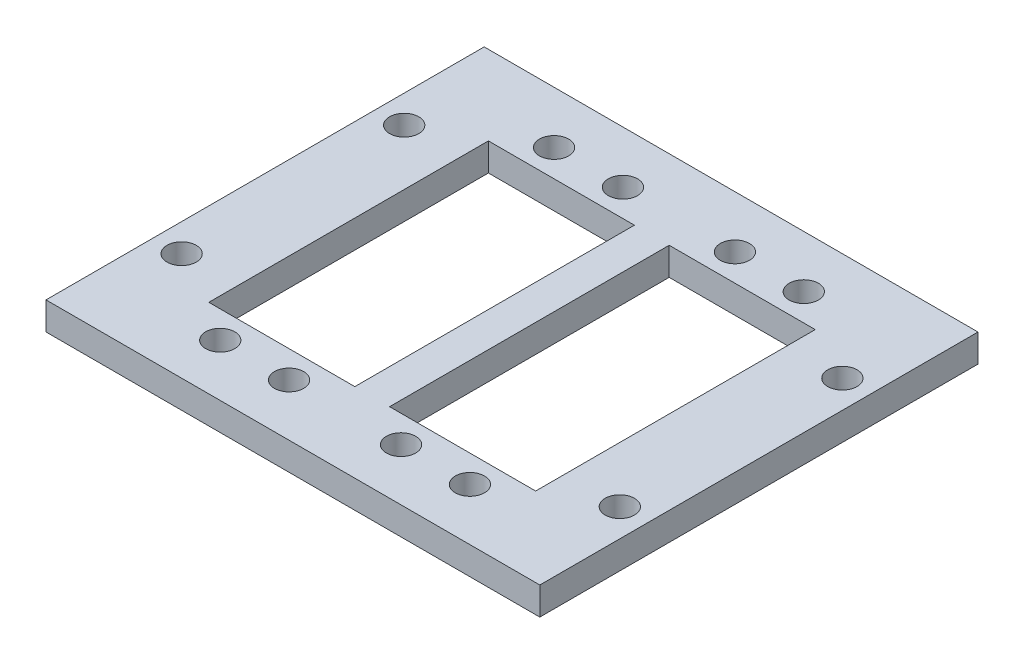
ISO-10303-21;
HEADER;
FILE_DESCRIPTION(('STEP AP214'),'2;1');
FILE_NAME('part.step','',(''),(''),'','','');
FILE_SCHEMA(('AUTOMOTIVE_DESIGN { 1 0 10303 214 1 1 1 1 }'));
ENDSEC;
DATA;
#1=APPLICATION_CONTEXT('core data for automotive mechanical design processes');
#2=APPLICATION_PROTOCOL_DEFINITION('international standard','automotive_design',2000,#1);
#3=PRODUCT_CONTEXT('',#1,'mechanical');
#4=PRODUCT('Part','Part','',(#3));
#5=PRODUCT_RELATED_PRODUCT_CATEGORY('part','',(#4));
#6=PRODUCT_DEFINITION_FORMATION('','',#4);
#7=PRODUCT_DEFINITION_CONTEXT('part definition',#1,'design');
#8=PRODUCT_DEFINITION('design','',#6,#7);
#9=PRODUCT_DEFINITION_SHAPE('','',#8);
#10=(LENGTH_UNIT() NAMED_UNIT(*) SI_UNIT(.MILLI.,.METRE.));
#11=(NAMED_UNIT(*) PLANE_ANGLE_UNIT() SI_UNIT($,.RADIAN.));
#12=(NAMED_UNIT(*) SI_UNIT($,.STERADIAN.) SOLID_ANGLE_UNIT());
#13=UNCERTAINTY_MEASURE_WITH_UNIT(LENGTH_MEASURE(1.E-05),#10,'distance_accuracy_value','');
#14=(GEOMETRIC_REPRESENTATION_CONTEXT(3) GLOBAL_UNCERTAINTY_ASSIGNED_CONTEXT((#13)) GLOBAL_UNIT_ASSIGNED_CONTEXT((#10,
#11,#12)) REPRESENTATION_CONTEXT('',''));
#15=CARTESIAN_POINT('',(0.,0.,0.));
#16=DIRECTION('',(0.,0.,1.));
#17=DIRECTION('',(1.,0.,0.));
#18=AXIS2_PLACEMENT_3D('',#15,#16,#17);
#19=CARTESIAN_POINT('',(0.,4.,-8.96010299831285));
#20=DIRECTION('',(0.,0.,-1.));
#21=DIRECTION('',(-1.,0.,0.));
#22=AXIS2_PLACEMENT_3D('',#19,#20,#21);
#23=PLANE('',#22);
#24=DIRECTION('',(1.,0.,0.));
#25=VECTOR('',#24,1.);
#26=CARTESIAN_POINT('',(0.,0.,-8.96010299831285));
#27=LINE('',#26,#25);
#28=CARTESIAN_POINT('',(-59.5851163441309,0.,-8.96010299831285));
#29=VERTEX_POINT('',#28);
#30=CARTESIAN_POINT('',(-38.5851163441309,0.,-8.96010299831285));
#31=VERTEX_POINT('',#30);
#32=EDGE_CURVE('E250',#29,#31,#27,.T.);
#33=ORIENTED_EDGE('',*,*,#32,.T.);
#34=DIRECTION('',(0.,-1.,0.));
#35=VECTOR('',#34,1.);
#36=CARTESIAN_POINT('',(-38.5851163441309,4.,-8.96010299831285));
#37=LINE('',#36,#35);
#38=CARTESIAN_POINT('',(-38.5851163441309,4.,-8.96010299831285));
#39=VERTEX_POINT('',#38);
#40=EDGE_CURVE('E11',#39,#31,#37,.T.);
#41=ORIENTED_EDGE('',*,*,#40,.F.);
#42=DIRECTION('',(1.,0.,0.));
#43=VECTOR('',#42,1.);
#44=CARTESIAN_POINT('',(0.,4.,-8.96010299831285));
#45=LINE('',#44,#43);
#46=CARTESIAN_POINT('',(-59.5851163441309,4.,-8.96010299831285));
#47=VERTEX_POINT('',#46);
#48=EDGE_CURVE('E150',#47,#39,#45,.T.);
#49=ORIENTED_EDGE('',*,*,#48,.F.);
#50=DIRECTION('',(0.,-1.,0.));
#51=VECTOR('',#50,1.);
#52=CARTESIAN_POINT('',(-59.5851163441309,4.,-8.96010299831285));
#53=LINE('',#52,#51);
#54=EDGE_CURVE('E65',#47,#29,#53,.T.);
#55=ORIENTED_EDGE('',*,*,#54,.T.);
#56=EDGE_LOOP('',(#33,#41,#49,#55));
#57=FACE_BOUND('',#56,.T.);
#58=ADVANCED_FACE('F45',(#57),#23,.F.);
#59=CARTESIAN_POINT('',(-38.5851163441309,4.,0.));
#60=DIRECTION('',(1.,0.,0.));
#61=DIRECTION('',(0.,0.,-1.));
#62=AXIS2_PLACEMENT_3D('',#59,#60,#61);
#63=PLANE('',#62);
#64=DIRECTION('',(0.,0.,1.));
#65=VECTOR('',#64,1.);
#66=CARTESIAN_POINT('',(-38.5851163441309,0.,0.));
#67=LINE('',#66,#65);
#68=CARTESIAN_POINT('',(-38.5851163441309,0.,31.2398970016872));
#69=VERTEX_POINT('',#68);
#70=EDGE_CURVE('E157',#31,#69,#67,.T.);
#71=ORIENTED_EDGE('',*,*,#70,.T.);
#72=DIRECTION('',(0.,-1.,0.));
#73=VECTOR('',#72,1.);
#74=CARTESIAN_POINT('',(-38.5851163441309,4.,31.2398970016872));
#75=LINE('',#74,#73);
#76=CARTESIAN_POINT('',(-38.5851163441309,4.,31.2398970016872));
#77=VERTEX_POINT('',#76);
#78=EDGE_CURVE('E56',#77,#69,#75,.T.);
#79=ORIENTED_EDGE('',*,*,#78,.F.);
#80=DIRECTION('',(0.,0.,1.));
#81=VECTOR('',#80,1.);
#82=CARTESIAN_POINT('',(-38.5851163441309,4.,0.));
#83=LINE('',#82,#81);
#84=EDGE_CURVE('E143',#39,#77,#83,.T.);
#85=ORIENTED_EDGE('',*,*,#84,.F.);
#86=ORIENTED_EDGE('',*,*,#40,.T.);
#87=EDGE_LOOP('',(#71,#79,#85,#86));
#88=FACE_BOUND('',#87,.T.);
#89=ADVANCED_FACE('F156',(#88),#63,.F.);
#90=CARTESIAN_POINT('',(0.,4.,31.2398970016872));
#91=DIRECTION('',(0.,0.,-1.));
#92=DIRECTION('',(-1.,0.,0.));
#93=AXIS2_PLACEMENT_3D('',#90,#91,#92);
#94=PLANE('',#93);
#95=DIRECTION('',(1.,0.,0.));
#96=VECTOR('',#95,1.);
#97=CARTESIAN_POINT('',(0.,0.,31.2398970016872));
#98=LINE('',#97,#96);
#99=CARTESIAN_POINT('',(-59.5851163441309,0.,31.2398970016872));
#100=VERTEX_POINT('',#99);
#101=EDGE_CURVE('E255',#100,#69,#98,.T.);
#102=ORIENTED_EDGE('',*,*,#101,.F.);
#103=DIRECTION('',(0.,-1.,0.));
#104=VECTOR('',#103,1.);
#105=CARTESIAN_POINT('',(-59.5851163441309,4.,31.2398970016872));
#106=LINE('',#105,#104);
#107=CARTESIAN_POINT('',(-59.5851163441309,4.,31.2398970016872));
#108=VERTEX_POINT('',#107);
#109=EDGE_CURVE('E103',#108,#100,#106,.T.);
#110=ORIENTED_EDGE('',*,*,#109,.F.);
#111=DIRECTION('',(1.,0.,0.));
#112=VECTOR('',#111,1.);
#113=CARTESIAN_POINT('',(0.,4.,31.2398970016872));
#114=LINE('',#113,#112);
#115=EDGE_CURVE('E149',#108,#77,#114,.T.);
#116=ORIENTED_EDGE('',*,*,#115,.T.);
#117=ORIENTED_EDGE('',*,*,#78,.T.);
#118=EDGE_LOOP('',(#102,#110,#116,#117));
#119=FACE_BOUND('',#118,.T.);
#120=ADVANCED_FACE('F162',(#119),#94,.T.);
#121=CARTESIAN_POINT('',(-26.5851163441308,4.,0.));
#122=DIRECTION('',(1.,0.,0.));
#123=DIRECTION('',(0.,0.,-1.));
#124=AXIS2_PLACEMENT_3D('',#121,#122,#123);
#125=PLANE('',#124);
#126=DIRECTION('',(0.,0.,1.));
#127=VECTOR('',#126,1.);
#128=CARTESIAN_POINT('',(-26.5851163441308,0.,0.));
#129=LINE('',#128,#127);
#130=CARTESIAN_POINT('',(-26.5851163441308,0.,-20.3601029983129));
#131=VERTEX_POINT('',#130);
#132=CARTESIAN_POINT('',(-26.5851163441308,0.,42.6398970016872));
#133=VERTEX_POINT('',#132);
#134=EDGE_CURVE('E234',#131,#133,#129,.T.);
#135=ORIENTED_EDGE('',*,*,#134,.F.);
#136=DIRECTION('',(0.,-1.,0.));
#137=VECTOR('',#136,1.);
#138=CARTESIAN_POINT('',(-26.5851163441308,4.,-20.3601029983129));
#139=LINE('',#138,#137);
#140=CARTESIAN_POINT('',(-26.5851163441308,4.,-20.3601029983129));
#141=VERTEX_POINT('',#140);
#142=EDGE_CURVE('E313',#141,#131,#139,.T.);
#143=ORIENTED_EDGE('',*,*,#142,.F.);
#144=DIRECTION('',(0.,0.,1.));
#145=VECTOR('',#144,1.);
#146=CARTESIAN_POINT('',(-26.5851163441308,4.,0.));
#147=LINE('',#146,#145);
#148=CARTESIAN_POINT('',(-26.5851163441308,4.,42.6398970016872));
#149=VERTEX_POINT('',#148);
#150=EDGE_CURVE('E618',#141,#149,#147,.T.);
#151=ORIENTED_EDGE('',*,*,#150,.T.);
#152=DIRECTION('',(0.,-1.,0.));
#153=VECTOR('',#152,1.);
#154=CARTESIAN_POINT('',(-26.5851163441308,4.,42.6398970016872));
#155=LINE('',#154,#153);
#156=EDGE_CURVE('E316',#149,#133,#155,.T.);
#157=ORIENTED_EDGE('',*,*,#156,.T.);
#158=EDGE_LOOP('',(#135,#143,#151,#157));
#159=FACE_BOUND('',#158,.T.);
#160=ADVANCED_FACE('F387',(#159),#125,.T.);
#161=CARTESIAN_POINT('',(0.,4.,-20.3601029983129));
#162=DIRECTION('',(0.,0.,-1.));
#163=DIRECTION('',(-1.,0.,0.));
#164=AXIS2_PLACEMENT_3D('',#161,#162,#163);
#165=PLANE('',#164);
#166=DIRECTION('',(1.,0.,0.));
#167=VECTOR('',#166,1.);
#168=CARTESIAN_POINT('',(0.,0.,-20.3601029983129));
#169=LINE('',#168,#167);
#170=CARTESIAN_POINT('',(-97.5851163441309,0.,-20.3601029983129));
#171=VERTEX_POINT('',#170);
#172=EDGE_CURVE('E238',#171,#131,#169,.T.);
#173=ORIENTED_EDGE('',*,*,#172,.F.);
#174=DIRECTION('',(0.,-1.,0.));
#175=VECTOR('',#174,1.);
#176=CARTESIAN_POINT('',(-97.5851163441309,4.,-20.3601029983129));
#177=LINE('',#176,#175);
#178=CARTESIAN_POINT('',(-97.5851163441309,4.,-20.3601029983129));
#179=VERTEX_POINT('',#178);
#180=EDGE_CURVE('E323',#179,#171,#177,.T.);
#181=ORIENTED_EDGE('',*,*,#180,.F.);
#182=DIRECTION('',(1.,0.,0.));
#183=VECTOR('',#182,1.);
#184=CARTESIAN_POINT('',(0.,4.,-20.3601029983129));
#185=LINE('',#184,#183);
#186=EDGE_CURVE('E614',#179,#141,#185,.T.);
#187=ORIENTED_EDGE('',*,*,#186,.T.);
#188=ORIENTED_EDGE('',*,*,#142,.T.);
#189=EDGE_LOOP('',(#173,#181,#187,#188));
#190=FACE_BOUND('',#189,.T.);
#191=ADVANCED_FACE('F383',(#190),#165,.T.);
#192=CARTESIAN_POINT('',(-97.5851163441309,4.,0.));
#193=DIRECTION('',(1.,0.,0.));
#194=DIRECTION('',(0.,0.,-1.));
#195=AXIS2_PLACEMENT_3D('',#192,#193,#194);
#196=PLANE('',#195);
#197=DIRECTION('',(0.,0.,1.));
#198=VECTOR('',#197,1.);
#199=CARTESIAN_POINT('',(-97.5851163441309,0.,0.));
#200=LINE('',#199,#198);
#201=CARTESIAN_POINT('',(-97.5851163441309,0.,42.6398970016872));
#202=VERTEX_POINT('',#201);
#203=EDGE_CURVE('E242',#171,#202,#200,.T.);
#204=ORIENTED_EDGE('',*,*,#203,.T.);
#205=DIRECTION('',(0.,-1.,0.));
#206=VECTOR('',#205,1.);
#207=CARTESIAN_POINT('',(-97.5851163441309,4.,42.6398970016872));
#208=LINE('',#207,#206);
#209=CARTESIAN_POINT('',(-97.5851163441309,4.,42.6398970016872));
#210=VERTEX_POINT('',#209);
#211=EDGE_CURVE('E319',#210,#202,#208,.T.);
#212=ORIENTED_EDGE('',*,*,#211,.F.);
#213=DIRECTION('',(0.,0.,1.));
#214=VECTOR('',#213,1.);
#215=CARTESIAN_POINT('',(-97.5851163441309,4.,0.));
#216=LINE('',#215,#214);
#217=EDGE_CURVE('E608',#179,#210,#216,.T.);
#218=ORIENTED_EDGE('',*,*,#217,.F.);
#219=ORIENTED_EDGE('',*,*,#180,.T.);
#220=EDGE_LOOP('',(#204,#212,#218,#219));
#221=FACE_BOUND('',#220,.T.);
#222=ADVANCED_FACE('F380',(#221),#196,.F.);
#223=CARTESIAN_POINT('',(-85.5767819878561,4.,0.));
#224=DIRECTION('',(1.,0.,0.));
#225=DIRECTION('',(0.,0.,-1.));
#226=AXIS2_PLACEMENT_3D('',#223,#224,#225);
#227=PLANE('',#226);
#228=DIRECTION('',(0.,0.,1.));
#229=VECTOR('',#228,1.);
#230=CARTESIAN_POINT('',(-85.5767819878561,0.,0.));
#231=LINE('',#230,#229);
#232=CARTESIAN_POINT('',(-85.5767819878561,0.,-8.96010299831285));
#233=VERTEX_POINT('',#232);
#234=CARTESIAN_POINT('',(-85.5767819878561,0.,31.2398970016872));
#235=VERTEX_POINT('',#234);
#236=EDGE_CURVE('E219',#233,#235,#231,.T.);
#237=ORIENTED_EDGE('',*,*,#236,.F.);
#238=DIRECTION('',(0.,-1.,0.));
#239=VECTOR('',#238,1.);
#240=CARTESIAN_POINT('',(-85.5767819878561,4.,-8.96010299831285));
#241=LINE('',#240,#239);
#242=CARTESIAN_POINT('',(-85.5767819878561,4.,-8.96010299831285));
#243=VERTEX_POINT('',#242);
#244=EDGE_CURVE('E49',#243,#233,#241,.T.);
#245=ORIENTED_EDGE('',*,*,#244,.F.);
#246=DIRECTION('',(0.,0.,1.));
#247=VECTOR('',#246,1.);
#248=CARTESIAN_POINT('',(-85.5767819878561,4.,0.));
#249=LINE('',#248,#247);
#250=CARTESIAN_POINT('',(-85.5767819878561,4.,31.2398970016872));
#251=VERTEX_POINT('',#250);
#252=EDGE_CURVE('E310',#243,#251,#249,.T.);
#253=ORIENTED_EDGE('',*,*,#252,.T.);
#254=DIRECTION('',(0.,-1.,0.));
#255=VECTOR('',#254,1.);
#256=CARTESIAN_POINT('',(-85.5767819878561,4.,31.2398970016872));
#257=LINE('',#256,#255);
#258=EDGE_CURVE('E218',#251,#235,#257,.T.);
#259=ORIENTED_EDGE('',*,*,#258,.T.);
#260=EDGE_LOOP('',(#237,#245,#253,#259));
#261=FACE_BOUND('',#260,.T.);
#262=ADVANCED_FACE('F47',(#261),#227,.T.);
#263=CARTESIAN_POINT('',(0.,4.,-8.96010299831285));
#264=DIRECTION('',(0.,0.,-1.));
#265=DIRECTION('',(-1.,0.,0.));
#266=AXIS2_PLACEMENT_3D('',#263,#264,#265);
#267=PLANE('',#266);
#268=DIRECTION('',(1.,0.,0.));
#269=VECTOR('',#268,1.);
#270=CARTESIAN_POINT('',(0.,0.,-8.96010299831285));
#271=LINE('',#270,#269);
#272=CARTESIAN_POINT('',(-64.5851163441309,0.,-8.96010299831285));
#273=VERTEX_POINT('',#272);
#274=EDGE_CURVE('E223',#233,#273,#271,.T.);
#275=ORIENTED_EDGE('',*,*,#274,.T.);
#276=DIRECTION('',(0.,-1.,0.));
#277=VECTOR('',#276,1.);
#278=CARTESIAN_POINT('',(-64.5851163441309,4.,-8.96010299831285));
#279=LINE('',#278,#277);
#280=CARTESIAN_POINT('',(-64.5851163441309,4.,-8.96010299831285));
#281=VERTEX_POINT('',#280);
#282=EDGE_CURVE('E332',#281,#273,#279,.T.);
#283=ORIENTED_EDGE('',*,*,#282,.F.);
#284=DIRECTION('',(1.,0.,0.));
#285=VECTOR('',#284,1.);
#286=CARTESIAN_POINT('',(0.,4.,-8.96010299831285));
#287=LINE('',#286,#285);
#288=EDGE_CURVE('E343',#243,#281,#287,.T.);
#289=ORIENTED_EDGE('',*,*,#288,.F.);
#290=ORIENTED_EDGE('',*,*,#244,.T.);
#291=EDGE_LOOP('',(#275,#283,#289,#290));
#292=FACE_BOUND('',#291,.T.);
#293=ADVANCED_FACE('F342',(#292),#267,.F.);
#294=CARTESIAN_POINT('',(-64.5851163441309,4.,0.));
#295=DIRECTION('',(1.,0.,0.));
#296=DIRECTION('',(0.,0.,-1.));
#297=AXIS2_PLACEMENT_3D('',#294,#295,#296);
#298=PLANE('',#297);
#299=DIRECTION('',(0.,0.,1.));
#300=VECTOR('',#299,1.);
#301=CARTESIAN_POINT('',(-64.5851163441309,0.,0.));
#302=LINE('',#301,#300);
#303=CARTESIAN_POINT('',(-64.5851163441309,0.,31.2398970016872));
#304=VERTEX_POINT('',#303);
#305=EDGE_CURVE('E226',#273,#304,#302,.T.);
#306=ORIENTED_EDGE('',*,*,#305,.T.);
#307=DIRECTION('',(0.,-1.,0.));
#308=VECTOR('',#307,1.);
#309=CARTESIAN_POINT('',(-64.5851163441309,4.,31.2398970016872));
#310=LINE('',#309,#308);
#311=CARTESIAN_POINT('',(-64.5851163441309,4.,31.2398970016872));
#312=VERTEX_POINT('',#311);
#313=EDGE_CURVE('E330',#312,#304,#310,.T.);
#314=ORIENTED_EDGE('',*,*,#313,.F.);
#315=DIRECTION('',(0.,0.,1.));
#316=VECTOR('',#315,1.);
#317=CARTESIAN_POINT('',(-64.5851163441309,4.,0.));
#318=LINE('',#317,#316);
#319=EDGE_CURVE('E624',#281,#312,#318,.T.);
#320=ORIENTED_EDGE('',*,*,#319,.F.);
#321=ORIENTED_EDGE('',*,*,#282,.T.);
#322=EDGE_LOOP('',(#306,#314,#320,#321));
#323=FACE_BOUND('',#322,.T.);
#324=ADVANCED_FACE('F355',(#323),#298,.F.);
#325=CARTESIAN_POINT('',(-30.5851163441309,4.,-4.86010299831285));
#326=DIRECTION('',(0.,-1.,0.));
#327=DIRECTION('',(0.,0.,-1.));
#328=AXIS2_PLACEMENT_3D('',#325,#326,#327);
#329=CYLINDRICAL_SURFACE('',#328,2.1);
#330=CARTESIAN_POINT('',(-30.5851163441309,4.,-4.86010299831285));
#331=DIRECTION('',(0.,1.,0.));
#332=DIRECTION('',(0.,0.,1.));
#333=AXIS2_PLACEMENT_3D('',#330,#331,#332);
#334=CIRCLE('',#333,2.1);
#335=CARTESIAN_POINT('',(-30.5851163441309,4.,-2.76010299831285));
#336=VERTEX_POINT('',#335);
#337=EDGE_CURVE('E210',#336,#336,#334,.T.);
#338=ORIENTED_EDGE('',*,*,#337,.T.);
#339=EDGE_LOOP('',(#338));
#340=FACE_BOUND('',#339,.T.);
#341=CARTESIAN_POINT('',(-30.5851163441309,0.,-4.86010299831285));
#342=DIRECTION('',(0.,1.,0.));
#343=DIRECTION('',(0.,0.,1.));
#344=AXIS2_PLACEMENT_3D('',#341,#342,#343);
#345=CIRCLE('',#344,2.1);
#346=CARTESIAN_POINT('',(-30.5851163441309,0.,-2.76010299831285));
#347=VERTEX_POINT('',#346);
#348=EDGE_CURVE('E302',#347,#347,#345,.T.);
#349=ORIENTED_EDGE('',*,*,#348,.F.);
#350=EDGE_LOOP('',(#349));
#351=FACE_BOUND('',#350,.T.);
#352=ADVANCED_FACE('F357',(#340,#351),#329,.F.);
#353=CARTESIAN_POINT('',(-44.1351163441309,4.,-12.8601029983128));
#354=DIRECTION('',(0.,-1.,0.));
#355=DIRECTION('',(0.,0.,-1.));
#356=AXIS2_PLACEMENT_3D('',#353,#354,#355);
#357=CYLINDRICAL_SURFACE('',#356,2.1);
#358=CARTESIAN_POINT('',(-44.1351163441309,4.,-12.8601029983128));
#359=DIRECTION('',(0.,1.,0.));
#360=DIRECTION('',(0.,0.,1.));
#361=AXIS2_PLACEMENT_3D('',#358,#359,#360);
#362=CIRCLE('',#361,2.1);
#363=CARTESIAN_POINT('',(-44.1351163441309,4.,-10.7601029983128));
#364=VERTEX_POINT('',#363);
#365=EDGE_CURVE('E206',#364,#364,#362,.T.);
#366=ORIENTED_EDGE('',*,*,#365,.T.);
#367=EDGE_LOOP('',(#366));
#368=FACE_BOUND('',#367,.T.);
#369=CARTESIAN_POINT('',(-44.1351163441309,0.,-12.8601029983128));
#370=DIRECTION('',(0.,1.,0.));
#371=DIRECTION('',(0.,0.,1.));
#372=AXIS2_PLACEMENT_3D('',#369,#370,#371);
#373=CIRCLE('',#372,2.1);
#374=CARTESIAN_POINT('',(-44.1351163441309,0.,-10.7601029983128));
#375=VERTEX_POINT('',#374);
#376=EDGE_CURVE('E298',#375,#375,#373,.T.);
#377=ORIENTED_EDGE('',*,*,#376,.F.);
#378=EDGE_LOOP('',(#377));
#379=FACE_BOUND('',#378,.T.);
#380=ADVANCED_FACE('F363',(#368,#379),#357,.F.);
#381=CARTESIAN_POINT('',(-54.0351163441309,4.,-12.8601029983129));
#382=DIRECTION('',(0.,-1.,0.));
#383=DIRECTION('',(0.,0.,-1.));
#384=AXIS2_PLACEMENT_3D('',#381,#382,#383);
#385=CYLINDRICAL_SURFACE('',#384,2.1);
#386=CARTESIAN_POINT('',(-54.0351163441309,4.,-12.8601029983129));
#387=DIRECTION('',(0.,1.,0.));
#388=DIRECTION('',(0.,0.,1.));
#389=AXIS2_PLACEMENT_3D('',#386,#387,#388);
#390=CIRCLE('',#389,2.1);
#391=CARTESIAN_POINT('',(-54.0351163441309,4.,-10.7601029983129));
#392=VERTEX_POINT('',#391);
#393=EDGE_CURVE('E202',#392,#392,#390,.T.);
#394=ORIENTED_EDGE('',*,*,#393,.T.);
#395=EDGE_LOOP('',(#394));
#396=FACE_BOUND('',#395,.T.);
#397=CARTESIAN_POINT('',(-54.0351163441309,0.,-12.8601029983129));
#398=DIRECTION('',(0.,1.,0.));
#399=DIRECTION('',(0.,0.,1.));
#400=AXIS2_PLACEMENT_3D('',#397,#398,#399);
#401=CIRCLE('',#400,2.1);
#402=CARTESIAN_POINT('',(-54.0351163441309,0.,-10.7601029983129));
#403=VERTEX_POINT('',#402);
#404=EDGE_CURVE('E294',#403,#403,#401,.T.);
#405=ORIENTED_EDGE('',*,*,#404,.F.);
#406=EDGE_LOOP('',(#405));
#407=FACE_BOUND('',#406,.T.);
#408=ADVANCED_FACE('F408',(#396,#407),#385,.F.);
#409=CARTESIAN_POINT('',(-70.1351163441309,4.,-12.8601029983129));
#410=DIRECTION('',(0.,-1.,0.));
#411=DIRECTION('',(0.,0.,-1.));
#412=AXIS2_PLACEMENT_3D('',#409,#410,#411);
#413=CYLINDRICAL_SURFACE('',#412,2.09999999999999);
#414=CARTESIAN_POINT('',(-70.1351163441309,4.,-12.8601029983129));
#415=DIRECTION('',(0.,1.,0.));
#416=DIRECTION('',(0.,0.,1.));
#417=AXIS2_PLACEMENT_3D('',#414,#415,#416);
#418=CIRCLE('',#417,2.09999999999999);
#419=CARTESIAN_POINT('',(-70.1351163441309,4.,-10.7601029983129));
#420=VERTEX_POINT('',#419);
#421=EDGE_CURVE('E198',#420,#420,#418,.T.);
#422=ORIENTED_EDGE('',*,*,#421,.T.);
#423=EDGE_LOOP('',(#422));
#424=FACE_BOUND('',#423,.T.);
#425=CARTESIAN_POINT('',(-70.1351163441309,0.,-12.8601029983129));
#426=DIRECTION('',(0.,1.,0.));
#427=DIRECTION('',(0.,0.,1.));
#428=AXIS2_PLACEMENT_3D('',#425,#426,#427);
#429=CIRCLE('',#428,2.09999999999999);
#430=CARTESIAN_POINT('',(-70.1351163441309,0.,-10.7601029983129));
#431=VERTEX_POINT('',#430);
#432=EDGE_CURVE('E290',#431,#431,#429,.T.);
#433=ORIENTED_EDGE('',*,*,#432,.F.);
#434=EDGE_LOOP('',(#433));
#435=FACE_BOUND('',#434,.T.);
#436=ADVANCED_FACE('F412',(#424,#435),#413,.F.);
#437=CARTESIAN_POINT('',(-80.0351163441309,4.,-12.8601029983129));
#438=DIRECTION('',(0.,-1.,0.));
#439=DIRECTION('',(0.,0.,-1.));
#440=AXIS2_PLACEMENT_3D('',#437,#438,#439);
#441=CYLINDRICAL_SURFACE('',#440,2.09999999999999);
#442=CARTESIAN_POINT('',(-80.0351163441309,4.,-12.8601029983129));
#443=DIRECTION('',(0.,1.,0.));
#444=DIRECTION('',(0.,0.,1.));
#445=AXIS2_PLACEMENT_3D('',#442,#443,#444);
#446=CIRCLE('',#445,2.09999999999999);
#447=CARTESIAN_POINT('',(-80.0351163441309,4.,-10.7601029983129));
#448=VERTEX_POINT('',#447);
#449=EDGE_CURVE('E194',#448,#448,#446,.T.);
#450=ORIENTED_EDGE('',*,*,#449,.T.);
#451=EDGE_LOOP('',(#450));
#452=FACE_BOUND('',#451,.T.);
#453=CARTESIAN_POINT('',(-80.0351163441309,0.,-12.8601029983129));
#454=DIRECTION('',(0.,1.,0.));
#455=DIRECTION('',(0.,0.,1.));
#456=AXIS2_PLACEMENT_3D('',#453,#454,#455);
#457=CIRCLE('',#456,2.09999999999999);
#458=CARTESIAN_POINT('',(-80.0351163441309,0.,-10.7601029983129));
#459=VERTEX_POINT('',#458);
#460=EDGE_CURVE('E286',#459,#459,#457,.T.);
#461=ORIENTED_EDGE('',*,*,#460,.F.);
#462=EDGE_LOOP('',(#461));
#463=FACE_BOUND('',#462,.T.);
#464=ADVANCED_FACE('F416',(#452,#463),#441,.F.);
#465=CARTESIAN_POINT('',(-93.5851163441309,4.,27.1398970016872));
#466=DIRECTION('',(0.,-1.,0.));
#467=DIRECTION('',(0.,0.,-1.));
#468=AXIS2_PLACEMENT_3D('',#465,#466,#467);
#469=CYLINDRICAL_SURFACE('',#468,2.10000000000002);
#470=CARTESIAN_POINT('',(-93.5851163441309,4.,27.1398970016872));
#471=DIRECTION('',(0.,1.,0.));
#472=DIRECTION('',(0.,0.,1.));
#473=AXIS2_PLACEMENT_3D('',#470,#471,#472);
#474=CIRCLE('',#473,2.10000000000002);
#475=CARTESIAN_POINT('',(-93.5851163441309,4.,29.2398970016872));
#476=VERTEX_POINT('',#475);
#477=EDGE_CURVE('E190',#476,#476,#474,.F.);
#478=ORIENTED_EDGE('',*,*,#477,.F.);
#479=EDGE_LOOP('',(#478));
#480=FACE_BOUND('',#479,.T.);
#481=CARTESIAN_POINT('',(-93.5851163441309,0.,27.1398970016872));
#482=DIRECTION('',(0.,1.,0.));
#483=DIRECTION('',(0.,0.,1.));
#484=AXIS2_PLACEMENT_3D('',#481,#482,#483);
#485=CIRCLE('',#484,2.10000000000002);
#486=CARTESIAN_POINT('',(-93.5851163441309,0.,29.2398970016872));
#487=VERTEX_POINT('',#486);
#488=EDGE_CURVE('E282',#487,#487,#485,.F.);
#489=ORIENTED_EDGE('',*,*,#488,.T.);
#490=EDGE_LOOP('',(#489));
#491=FACE_BOUND('',#490,.T.);
#492=ADVANCED_FACE('F420',(#480,#491),#469,.F.);
#493=CARTESIAN_POINT('',(-80.0351163441309,4.,35.1398970016872));
#494=DIRECTION('',(0.,-1.,0.));
#495=DIRECTION('',(0.,0.,-1.));
#496=AXIS2_PLACEMENT_3D('',#493,#494,#495);
#497=CYLINDRICAL_SURFACE('',#496,2.09999999999999);
#498=CARTESIAN_POINT('',(-80.0351163441309,4.,35.1398970016872));
#499=DIRECTION('',(0.,1.,0.));
#500=DIRECTION('',(0.,0.,1.));
#501=AXIS2_PLACEMENT_3D('',#498,#499,#500);
#502=CIRCLE('',#501,2.09999999999999);
#503=CARTESIAN_POINT('',(-80.0351163441309,4.,37.2398970016872));
#504=VERTEX_POINT('',#503);
#505=EDGE_CURVE('E186',#504,#504,#502,.F.);
#506=ORIENTED_EDGE('',*,*,#505,.F.);
#507=EDGE_LOOP('',(#506));
#508=FACE_BOUND('',#507,.T.);
#509=CARTESIAN_POINT('',(-80.0351163441309,0.,35.1398970016872));
#510=DIRECTION('',(0.,1.,0.));
#511=DIRECTION('',(0.,0.,1.));
#512=AXIS2_PLACEMENT_3D('',#509,#510,#511);
#513=CIRCLE('',#512,2.09999999999999);
#514=CARTESIAN_POINT('',(-80.0351163441309,0.,37.2398970016872));
#515=VERTEX_POINT('',#514);
#516=EDGE_CURVE('E278',#515,#515,#513,.F.);
#517=ORIENTED_EDGE('',*,*,#516,.T.);
#518=EDGE_LOOP('',(#517));
#519=FACE_BOUND('',#518,.T.);
#520=ADVANCED_FACE('F424',(#508,#519),#497,.F.);
#521=CARTESIAN_POINT('',(-44.1351163441309,4.,35.1398970016872));
#522=DIRECTION('',(0.,-1.,0.));
#523=DIRECTION('',(0.,0.,-1.));
#524=AXIS2_PLACEMENT_3D('',#521,#522,#523);
#525=CYLINDRICAL_SURFACE('',#524,2.1);
#526=CARTESIAN_POINT('',(-44.1351163441309,4.,35.1398970016872));
#527=DIRECTION('',(0.,1.,0.));
#528=DIRECTION('',(0.,0.,1.));
#529=AXIS2_PLACEMENT_3D('',#526,#527,#528);
#530=CIRCLE('',#529,2.1);
#531=CARTESIAN_POINT('',(-44.1351163441309,4.,37.2398970016872));
#532=VERTEX_POINT('',#531);
#533=EDGE_CURVE('E182',#532,#532,#530,.F.);
#534=ORIENTED_EDGE('',*,*,#533,.F.);
#535=EDGE_LOOP('',(#534));
#536=FACE_BOUND('',#535,.T.);
#537=CARTESIAN_POINT('',(-44.1351163441309,0.,35.1398970016872));
#538=DIRECTION('',(0.,1.,0.));
#539=DIRECTION('',(0.,0.,1.));
#540=AXIS2_PLACEMENT_3D('',#537,#538,#539);
#541=CIRCLE('',#540,2.1);
#542=CARTESIAN_POINT('',(-44.1351163441309,0.,37.2398970016872));
#543=VERTEX_POINT('',#542);
#544=EDGE_CURVE('E274',#543,#543,#541,.F.);
#545=ORIENTED_EDGE('',*,*,#544,.T.);
#546=EDGE_LOOP('',(#545));
#547=FACE_BOUND('',#546,.T.);
#548=ADVANCED_FACE('F428',(#536,#547),#525,.F.);
#549=CARTESIAN_POINT('',(-30.5851163441309,4.,27.1398970016872));
#550=DIRECTION('',(0.,-1.,0.));
#551=DIRECTION('',(0.,0.,-1.));
#552=AXIS2_PLACEMENT_3D('',#549,#550,#551);
#553=CYLINDRICAL_SURFACE('',#552,2.1);
#554=CARTESIAN_POINT('',(-30.5851163441309,4.,27.1398970016872));
#555=DIRECTION('',(0.,1.,0.));
#556=DIRECTION('',(0.,0.,1.));
#557=AXIS2_PLACEMENT_3D('',#554,#555,#556);
#558=CIRCLE('',#557,2.1);
#559=CARTESIAN_POINT('',(-30.5851163441309,4.,29.2398970016872));
#560=VERTEX_POINT('',#559);
#561=EDGE_CURVE('E178',#560,#560,#558,.F.);
#562=ORIENTED_EDGE('',*,*,#561,.F.);
#563=EDGE_LOOP('',(#562));
#564=FACE_BOUND('',#563,.T.);
#565=CARTESIAN_POINT('',(-30.5851163441309,0.,27.1398970016872));
#566=DIRECTION('',(0.,1.,0.));
#567=DIRECTION('',(0.,0.,1.));
#568=AXIS2_PLACEMENT_3D('',#565,#566,#567);
#569=CIRCLE('',#568,2.1);
#570=CARTESIAN_POINT('',(-30.5851163441309,0.,29.2398970016872));
#571=VERTEX_POINT('',#570);
#572=EDGE_CURVE('E270',#571,#571,#569,.F.);
#573=ORIENTED_EDGE('',*,*,#572,.T.);
#574=EDGE_LOOP('',(#573));
#575=FACE_BOUND('',#574,.T.);
#576=ADVANCED_FACE('F432',(#564,#575),#553,.F.);
#577=CARTESIAN_POINT('',(-54.0351163441309,4.,35.1398970016872));
#578=DIRECTION('',(0.,-1.,0.));
#579=DIRECTION('',(0.,0.,-1.));
#580=AXIS2_PLACEMENT_3D('',#577,#578,#579);
#581=CYLINDRICAL_SURFACE('',#580,2.1);
#582=CARTESIAN_POINT('',(-54.0351163441309,4.,35.1398970016872));
#583=DIRECTION('',(0.,1.,0.));
#584=DIRECTION('',(0.,0.,1.));
#585=AXIS2_PLACEMENT_3D('',#582,#583,#584);
#586=CIRCLE('',#585,2.1);
#587=CARTESIAN_POINT('',(-54.0351163441309,4.,37.2398970016872));
#588=VERTEX_POINT('',#587);
#589=EDGE_CURVE('E174',#588,#588,#586,.F.);
#590=ORIENTED_EDGE('',*,*,#589,.F.);
#591=EDGE_LOOP('',(#590));
#592=FACE_BOUND('',#591,.T.);
#593=CARTESIAN_POINT('',(-54.0351163441309,0.,35.1398970016872));
#594=DIRECTION('',(0.,1.,0.));
#595=DIRECTION('',(0.,0.,1.));
#596=AXIS2_PLACEMENT_3D('',#593,#594,#595);
#597=CIRCLE('',#596,2.1);
#598=CARTESIAN_POINT('',(-54.0351163441309,0.,37.2398970016872));
#599=VERTEX_POINT('',#598);
#600=EDGE_CURVE('E266',#599,#599,#597,.F.);
#601=ORIENTED_EDGE('',*,*,#600,.T.);
#602=EDGE_LOOP('',(#601));
#603=FACE_BOUND('',#602,.T.);
#604=ADVANCED_FACE('F436',(#592,#603),#581,.F.);
#605=CARTESIAN_POINT('',(-70.1351163441309,4.,35.1398970016872));
#606=DIRECTION('',(0.,-1.,0.));
#607=DIRECTION('',(0.,0.,-1.));
#608=AXIS2_PLACEMENT_3D('',#605,#606,#607);
#609=CYLINDRICAL_SURFACE('',#608,2.09999999999999);
#610=CARTESIAN_POINT('',(-70.1351163441309,4.,35.1398970016872));
#611=DIRECTION('',(0.,1.,0.));
#612=DIRECTION('',(0.,0.,1.));
#613=AXIS2_PLACEMENT_3D('',#610,#611,#612);
#614=CIRCLE('',#613,2.09999999999999);
#615=CARTESIAN_POINT('',(-70.1351163441309,4.,37.2398970016872));
#616=VERTEX_POINT('',#615);
#617=EDGE_CURVE('E167',#616,#616,#614,.F.);
#618=ORIENTED_EDGE('',*,*,#617,.F.);
#619=EDGE_LOOP('',(#618));
#620=FACE_BOUND('',#619,.T.);
#621=CARTESIAN_POINT('',(-70.1351163441309,0.,35.1398970016872));
#622=DIRECTION('',(0.,1.,0.));
#623=DIRECTION('',(0.,0.,1.));
#624=AXIS2_PLACEMENT_3D('',#621,#622,#623);
#625=CIRCLE('',#624,2.09999999999999);
#626=CARTESIAN_POINT('',(-70.1351163441309,0.,37.2398970016872));
#627=VERTEX_POINT('',#626);
#628=EDGE_CURVE('E262',#627,#627,#625,.F.);
#629=ORIENTED_EDGE('',*,*,#628,.T.);
#630=EDGE_LOOP('',(#629));
#631=FACE_BOUND('',#630,.T.);
#632=ADVANCED_FACE('F440',(#620,#631),#609,.F.);
#633=CARTESIAN_POINT('',(-59.5851163441309,4.,0.));
#634=DIRECTION('',(1.,0.,0.));
#635=DIRECTION('',(0.,0.,-1.));
#636=AXIS2_PLACEMENT_3D('',#633,#634,#635);
#637=PLANE('',#636);
#638=DIRECTION('',(0.,0.,1.));
#639=VECTOR('',#638,1.);
#640=CARTESIAN_POINT('',(-59.5851163441309,0.,0.));
#641=LINE('',#640,#639);
#642=EDGE_CURVE('E258',#29,#100,#641,.T.);
#643=ORIENTED_EDGE('',*,*,#642,.F.);
#644=ORIENTED_EDGE('',*,*,#54,.F.);
#645=DIRECTION('',(0.,0.,1.));
#646=VECTOR('',#645,1.);
#647=CARTESIAN_POINT('',(-59.5851163441309,4.,0.));
#648=LINE('',#647,#646);
#649=EDGE_CURVE('E164',#47,#108,#648,.T.);
#650=ORIENTED_EDGE('',*,*,#649,.T.);
#651=ORIENTED_EDGE('',*,*,#109,.T.);
#652=EDGE_LOOP('',(#643,#644,#650,#651));
#653=FACE_BOUND('',#652,.T.);
#654=ADVANCED_FACE('F378',(#653),#637,.T.);
#655=CARTESIAN_POINT('',(0.,4.,42.6398970016872));
#656=DIRECTION('',(0.,0.,-1.));
#657=DIRECTION('',(-1.,0.,0.));
#658=AXIS2_PLACEMENT_3D('',#655,#656,#657);
#659=PLANE('',#658);
#660=DIRECTION('',(1.,0.,0.));
#661=VECTOR('',#660,1.);
#662=CARTESIAN_POINT('',(0.,0.,42.6398970016872));
#663=LINE('',#662,#661);
#664=EDGE_CURVE('E246',#202,#133,#663,.T.);
#665=ORIENTED_EDGE('',*,*,#664,.T.);
#666=ORIENTED_EDGE('',*,*,#156,.F.);
#667=DIRECTION('',(1.,0.,0.));
#668=VECTOR('',#667,1.);
#669=CARTESIAN_POINT('',(0.,4.,42.6398970016872));
#670=LINE('',#669,#668);
#671=EDGE_CURVE('E606',#210,#149,#670,.T.);
#672=ORIENTED_EDGE('',*,*,#671,.F.);
#673=ORIENTED_EDGE('',*,*,#211,.T.);
#674=EDGE_LOOP('',(#665,#666,#672,#673));
#675=FACE_BOUND('',#674,.T.);
#676=ADVANCED_FACE('F375',(#675),#659,.F.);
#677=CARTESIAN_POINT('',(0.,4.,31.2398970016872));
#678=DIRECTION('',(0.,0.,-1.));
#679=DIRECTION('',(-1.,0.,0.));
#680=AXIS2_PLACEMENT_3D('',#677,#678,#679);
#681=PLANE('',#680);
#682=DIRECTION('',(1.,0.,0.));
#683=VECTOR('',#682,1.);
#684=CARTESIAN_POINT('',(0.,0.,31.2398970016872));
#685=LINE('',#684,#683);
#686=EDGE_CURVE('E230',#235,#304,#685,.T.);
#687=ORIENTED_EDGE('',*,*,#686,.F.);
#688=ORIENTED_EDGE('',*,*,#258,.F.);
#689=DIRECTION('',(1.,0.,0.));
#690=VECTOR('',#689,1.);
#691=CARTESIAN_POINT('',(0.,4.,31.2398970016872));
#692=LINE('',#691,#690);
#693=EDGE_CURVE('E353',#251,#312,#692,.T.);
#694=ORIENTED_EDGE('',*,*,#693,.T.);
#695=ORIENTED_EDGE('',*,*,#313,.T.);
#696=EDGE_LOOP('',(#687,#688,#694,#695));
#697=FACE_BOUND('',#696,.T.);
#698=ADVANCED_FACE('F352',(#697),#681,.T.);
#699=CARTESIAN_POINT('',(-93.5851163441309,4.,-4.86010299831286));
#700=DIRECTION('',(0.,-1.,0.));
#701=DIRECTION('',(0.,0.,-1.));
#702=AXIS2_PLACEMENT_3D('',#699,#700,#701);
#703=CYLINDRICAL_SURFACE('',#702,2.10000000000002);
#704=CARTESIAN_POINT('',(-93.5851163441309,4.,-4.86010299831286));
#705=DIRECTION('',(0.,1.,0.));
#706=DIRECTION('',(0.,0.,1.));
#707=AXIS2_PLACEMENT_3D('',#704,#705,#706);
#708=CIRCLE('',#707,2.10000000000002);
#709=CARTESIAN_POINT('',(-93.5851163441309,4.,-2.76010299831284));
#710=VERTEX_POINT('',#709);
#711=EDGE_CURVE('E214',#710,#710,#708,.T.);
#712=ORIENTED_EDGE('',*,*,#711,.T.);
#713=EDGE_LOOP('',(#712));
#714=FACE_BOUND('',#713,.T.);
#715=CARTESIAN_POINT('',(-93.5851163441309,0.,-4.86010299831286));
#716=DIRECTION('',(0.,1.,0.));
#717=DIRECTION('',(0.,0.,1.));
#718=AXIS2_PLACEMENT_3D('',#715,#716,#717);
#719=CIRCLE('',#718,2.10000000000002);
#720=CARTESIAN_POINT('',(-93.5851163441309,0.,-2.76010299831284));
#721=VERTEX_POINT('',#720);
#722=EDGE_CURVE('E306',#721,#721,#719,.T.);
#723=ORIENTED_EDGE('',*,*,#722,.F.);
#724=EDGE_LOOP('',(#723));
#725=FACE_BOUND('',#724,.T.);
#726=ADVANCED_FACE('F392',(#714,#725),#703,.F.);
#727=CARTESIAN_POINT('',(0.,4.,0.));
#728=DIRECTION('',(0.,1.,0.));
#729=DIRECTION('',(0.,0.,1.));
#730=AXIS2_PLACEMENT_3D('',#727,#728,#729);
#731=PLANE('',#730);
#732=ORIENTED_EDGE('',*,*,#252,.F.);
#733=ORIENTED_EDGE('',*,*,#288,.T.);
#734=ORIENTED_EDGE('',*,*,#319,.T.);
#735=ORIENTED_EDGE('',*,*,#693,.F.);
#736=EDGE_LOOP('',(#732,#733,#734,#735));
#737=FACE_BOUND('',#736,.T.);
#738=ORIENTED_EDGE('',*,*,#150,.F.);
#739=ORIENTED_EDGE('',*,*,#186,.F.);
#740=ORIENTED_EDGE('',*,*,#217,.T.);
#741=ORIENTED_EDGE('',*,*,#671,.T.);
#742=EDGE_LOOP('',(#738,#739,#740,#741));
#743=FACE_BOUND('',#742,.T.);
#744=ORIENTED_EDGE('',*,*,#48,.T.);
#745=ORIENTED_EDGE('',*,*,#84,.T.);
#746=ORIENTED_EDGE('',*,*,#115,.F.);
#747=ORIENTED_EDGE('',*,*,#649,.F.);
#748=EDGE_LOOP('',(#744,#745,#746,#747));
#749=FACE_BOUND('',#748,.T.);
#750=ORIENTED_EDGE('',*,*,#617,.T.);
#751=EDGE_LOOP('',(#750));
#752=FACE_BOUND('',#751,.T.);
#753=ORIENTED_EDGE('',*,*,#589,.T.);
#754=EDGE_LOOP('',(#753));
#755=FACE_BOUND('',#754,.T.);
#756=ORIENTED_EDGE('',*,*,#561,.T.);
#757=EDGE_LOOP('',(#756));
#758=FACE_BOUND('',#757,.T.);
#759=ORIENTED_EDGE('',*,*,#533,.T.);
#760=EDGE_LOOP('',(#759));
#761=FACE_BOUND('',#760,.T.);
#762=ORIENTED_EDGE('',*,*,#505,.T.);
#763=EDGE_LOOP('',(#762));
#764=FACE_BOUND('',#763,.T.);
#765=ORIENTED_EDGE('',*,*,#477,.T.);
#766=EDGE_LOOP('',(#765));
#767=FACE_BOUND('',#766,.T.);
#768=ORIENTED_EDGE('',*,*,#449,.F.);
#769=EDGE_LOOP('',(#768));
#770=FACE_BOUND('',#769,.T.);
#771=ORIENTED_EDGE('',*,*,#421,.F.);
#772=EDGE_LOOP('',(#771));
#773=FACE_BOUND('',#772,.T.);
#774=ORIENTED_EDGE('',*,*,#393,.F.);
#775=EDGE_LOOP('',(#774));
#776=FACE_BOUND('',#775,.T.);
#777=ORIENTED_EDGE('',*,*,#365,.F.);
#778=EDGE_LOOP('',(#777));
#779=FACE_BOUND('',#778,.T.);
#780=ORIENTED_EDGE('',*,*,#337,.F.);
#781=EDGE_LOOP('',(#780));
#782=FACE_BOUND('',#781,.T.);
#783=ORIENTED_EDGE('',*,*,#711,.F.);
#784=EDGE_LOOP('',(#783));
#785=FACE_BOUND('',#784,.T.);
#786=ADVANCED_FACE('F145',(#737,#743,#749,#752,#755,#758,#761,#764,#767,#770,#773,#776,#779,
#782,#785),#731,.T.);
#787=CARTESIAN_POINT('',(0.,0.,0.));
#788=DIRECTION('',(0.,1.,0.));
#789=DIRECTION('',(0.,0.,1.));
#790=AXIS2_PLACEMENT_3D('',#787,#788,#789);
#791=PLANE('',#790);
#792=ORIENTED_EDGE('',*,*,#236,.T.);
#793=ORIENTED_EDGE('',*,*,#686,.T.);
#794=ORIENTED_EDGE('',*,*,#305,.F.);
#795=ORIENTED_EDGE('',*,*,#274,.F.);
#796=EDGE_LOOP('',(#792,#793,#794,#795));
#797=FACE_BOUND('',#796,.T.);
#798=ORIENTED_EDGE('',*,*,#134,.T.);
#799=ORIENTED_EDGE('',*,*,#664,.F.);
#800=ORIENTED_EDGE('',*,*,#203,.F.);
#801=ORIENTED_EDGE('',*,*,#172,.T.);
#802=EDGE_LOOP('',(#798,#799,#800,#801));
#803=FACE_BOUND('',#802,.T.);
#804=ORIENTED_EDGE('',*,*,#32,.F.);
#805=ORIENTED_EDGE('',*,*,#642,.T.);
#806=ORIENTED_EDGE('',*,*,#101,.T.);
#807=ORIENTED_EDGE('',*,*,#70,.F.);
#808=EDGE_LOOP('',(#804,#805,#806,#807));
#809=FACE_BOUND('',#808,.T.);
#810=ORIENTED_EDGE('',*,*,#628,.F.);
#811=EDGE_LOOP('',(#810));
#812=FACE_BOUND('',#811,.T.);
#813=ORIENTED_EDGE('',*,*,#600,.F.);
#814=EDGE_LOOP('',(#813));
#815=FACE_BOUND('',#814,.T.);
#816=ORIENTED_EDGE('',*,*,#572,.F.);
#817=EDGE_LOOP('',(#816));
#818=FACE_BOUND('',#817,.T.);
#819=ORIENTED_EDGE('',*,*,#544,.F.);
#820=EDGE_LOOP('',(#819));
#821=FACE_BOUND('',#820,.T.);
#822=ORIENTED_EDGE('',*,*,#516,.F.);
#823=EDGE_LOOP('',(#822));
#824=FACE_BOUND('',#823,.T.);
#825=ORIENTED_EDGE('',*,*,#488,.F.);
#826=EDGE_LOOP('',(#825));
#827=FACE_BOUND('',#826,.T.);
#828=ORIENTED_EDGE('',*,*,#460,.T.);
#829=EDGE_LOOP('',(#828));
#830=FACE_BOUND('',#829,.T.);
#831=ORIENTED_EDGE('',*,*,#432,.T.);
#832=EDGE_LOOP('',(#831));
#833=FACE_BOUND('',#832,.T.);
#834=ORIENTED_EDGE('',*,*,#404,.T.);
#835=EDGE_LOOP('',(#834));
#836=FACE_BOUND('',#835,.T.);
#837=ORIENTED_EDGE('',*,*,#376,.T.);
#838=EDGE_LOOP('',(#837));
#839=FACE_BOUND('',#838,.T.);
#840=ORIENTED_EDGE('',*,*,#348,.T.);
#841=EDGE_LOOP('',(#840));
#842=FACE_BOUND('',#841,.T.);
#843=ORIENTED_EDGE('',*,*,#722,.T.);
#844=EDGE_LOOP('',(#843));
#845=FACE_BOUND('',#844,.T.);
#846=ADVANCED_FACE('F346',(#797,#803,#809,#812,#815,#818,#821,#824,#827,#830,#833,#836,#839,
#842,#845),#791,.F.);
#847=CLOSED_SHELL('',(#58,#89,#120,#160,#191,#222,#262,#293,#324,#352,#380,#408,#436,#464,#492,
#520,#548,#576,#604,#632,#654,#676,#698,#726,#786,#846));
#848=MANIFOLD_SOLID_BREP('B2',#847);
#849=ADVANCED_BREP_SHAPE_REPRESENTATION('',(#18,#848),#14);
#850=SHAPE_DEFINITION_REPRESENTATION(#9,#849);
ENDSEC;
END-ISO-10303-21;
